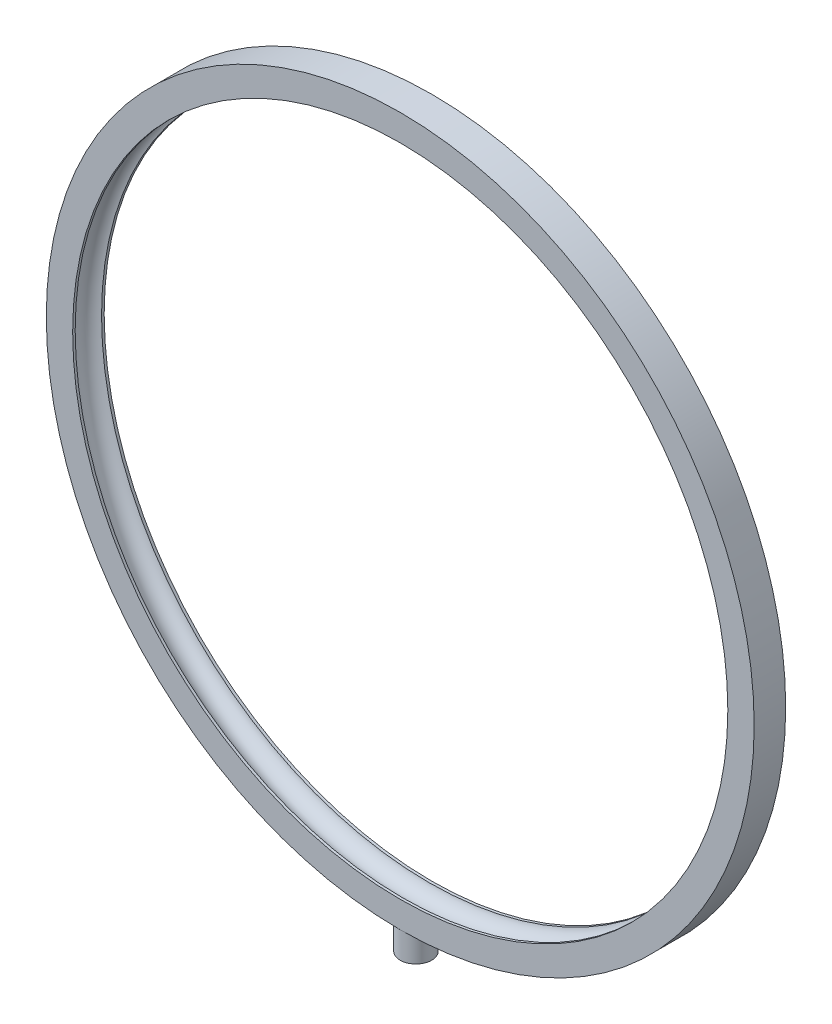
ISO-10303-21;
HEADER;
FILE_DESCRIPTION(('STEP AP214'),'2;1');
FILE_NAME('part.step','',(''),(''),'','','');
FILE_SCHEMA(('AUTOMOTIVE_DESIGN { 1 0 10303 214 1 1 1 1 }'));
ENDSEC;
DATA;
#1=APPLICATION_CONTEXT('core data for automotive mechanical design processes');
#2=APPLICATION_PROTOCOL_DEFINITION('international standard','automotive_design',2000,#1);
#3=PRODUCT_CONTEXT('',#1,'mechanical');
#4=PRODUCT('Part','Part','',(#3));
#5=PRODUCT_RELATED_PRODUCT_CATEGORY('part','',(#4));
#6=PRODUCT_DEFINITION_FORMATION('','',#4);
#7=PRODUCT_DEFINITION_CONTEXT('part definition',#1,'design');
#8=PRODUCT_DEFINITION('design','',#6,#7);
#9=PRODUCT_DEFINITION_SHAPE('','',#8);
#10=(LENGTH_UNIT() NAMED_UNIT(*) SI_UNIT(.MILLI.,.METRE.));
#11=(NAMED_UNIT(*) PLANE_ANGLE_UNIT() SI_UNIT($,.RADIAN.));
#12=(NAMED_UNIT(*) SI_UNIT($,.STERADIAN.) SOLID_ANGLE_UNIT());
#13=UNCERTAINTY_MEASURE_WITH_UNIT(LENGTH_MEASURE(1.E-05),#10,'distance_accuracy_value','');
#14=(GEOMETRIC_REPRESENTATION_CONTEXT(3) GLOBAL_UNCERTAINTY_ASSIGNED_CONTEXT((#13)) GLOBAL_UNIT_ASSIGNED_CONTEXT((#10,
#11,#12)) REPRESENTATION_CONTEXT('',''));
#15=CARTESIAN_POINT('',(0.,0.,0.));
#16=DIRECTION('',(0.,0.,1.));
#17=DIRECTION('',(1.,0.,0.));
#18=AXIS2_PLACEMENT_3D('',#15,#16,#17);
#19=CARTESIAN_POINT('',(0.,-144.24716621,0.));
#20=DIRECTION('',(0.,1.,0.));
#21=DIRECTION('',(0.,0.,1.));
#22=AXIS2_PLACEMENT_3D('',#19,#20,#21);
#23=CYLINDRICAL_SURFACE('',#22,5.975);
#24=CARTESIAN_POINT('',(0.,-144.24716621,0.));
#25=DIRECTION('',(0.,-1.,0.));
#26=DIRECTION('',(0.,0.,-1.));
#27=AXIS2_PLACEMENT_3D('',#24,#25,#26);
#28=CIRCLE('',#27,5.975);
#29=CARTESIAN_POINT('',(0.,-144.24716621,-5.975));
#30=VERTEX_POINT('',#29);
#31=EDGE_CURVE('E11',#30,#30,#28,.T.);
#32=ORIENTED_EDGE('',*,*,#31,.F.);
#33=EDGE_LOOP('',(#32));
#34=FACE_BOUND('',#33,.T.);
#35=CARTESIAN_POINT('',(0.,-134.24716621,0.));
#36=DIRECTION('',(0.,-1.,0.));
#37=DIRECTION('',(0.,0.,-1.));
#38=AXIS2_PLACEMENT_3D('',#35,#36,#37);
#39=CIRCLE('',#38,5.975);
#40=CARTESIAN_POINT('',(0.,-134.24716621,-5.975));
#41=VERTEX_POINT('',#40);
#42=EDGE_CURVE('E48',#41,#41,#39,.T.);
#43=ORIENTED_EDGE('',*,*,#42,.T.);
#44=EDGE_LOOP('',(#43));
#45=FACE_BOUND('',#44,.T.);
#46=ADVANCED_FACE('F45',(#34,#45),#23,.T.);
#47=CARTESIAN_POINT('',(0.,-144.24716621,0.));
#48=DIRECTION('',(0.,-1.,0.));
#49=DIRECTION('',(0.,0.,-1.));
#50=AXIS2_PLACEMENT_3D('',#47,#48,#49);
#51=PLANE('',#50);
#52=ORIENTED_EDGE('',*,*,#31,.T.);
#53=EDGE_LOOP('',(#52));
#54=FACE_BOUND('',#53,.T.);
#55=ADVANCED_FACE('F60',(#54),#51,.T.);
#56=CARTESIAN_POINT('',(0.,-134.24716621,0.));
#57=DIRECTION('',(0.,-1.,0.));
#58=DIRECTION('',(0.,0.,-1.));
#59=AXIS2_PLACEMENT_3D('',#56,#57,#58);
#60=PLANE('',#59);
#61=ORIENTED_EDGE('',*,*,#42,.F.);
#62=EDGE_LOOP('',(#61));
#63=FACE_BOUND('',#62,.T.);
#64=ADVANCED_FACE('F58',(#63),#60,.F.);
#65=CLOSED_SHELL('',(#46,#55,#64));
#66=MANIFOLD_SOLID_BREP('B2',#65);
#67=CARTESIAN_POINT('',(0.,0.,30.3023401497147));
#68=DIRECTION('',(0.,0.,1.));
#69=DIRECTION('',(1.,0.,0.));
#70=AXIS2_PLACEMENT_3D('',#67,#68,#69);
#71=CYLINDRICAL_SURFACE('',#70,124.24716621);
#72=CARTESIAN_POINT('',(0.,0.,-6.));
#73=DIRECTION('',(0.,0.,1.));
#74=DIRECTION('',(1.,0.,0.));
#75=AXIS2_PLACEMENT_3D('',#72,#73,#74);
#76=CIRCLE('',#75,124.24716621);
#77=CARTESIAN_POINT('',(124.24716621,0.,-6.));
#78=VERTEX_POINT('',#77);
#79=EDGE_CURVE('E44',#78,#78,#76,.T.);
#80=ORIENTED_EDGE('',*,*,#79,.F.);
#81=EDGE_LOOP('',(#80));
#82=FACE_BOUND('',#81,.T.);
#83=CARTESIAN_POINT('',(0.,0.,-5.));
#84=DIRECTION('',(0.,0.,1.));
#85=DIRECTION('',(1.,0.,0.));
#86=AXIS2_PLACEMENT_3D('',#83,#84,#85);
#87=CIRCLE('',#86,124.24716621);
#88=CARTESIAN_POINT('',(124.24716621,0.,-5.));
#89=VERTEX_POINT('',#88);
#90=EDGE_CURVE('E113',#89,#89,#87,.T.);
#91=ORIENTED_EDGE('',*,*,#90,.T.);
#92=EDGE_LOOP('',(#91));
#93=FACE_BOUND('',#92,.T.);
#94=ADVANCED_FACE('F86',(#82,#93),#71,.F.);
#95=CARTESIAN_POINT('',(0.,134.24716621,-6.));
#96=DIRECTION('',(0.,0.,1.));
#97=DIRECTION('',(1.,0.,0.));
#98=AXIS2_PLACEMENT_3D('',#95,#96,#97);
#99=PLANE('',#98);
#100=CARTESIAN_POINT('',(0.,0.,-6.));
#101=DIRECTION('',(0.,0.,1.));
#102=DIRECTION('',(1.,0.,0.));
#103=AXIS2_PLACEMENT_3D('',#100,#101,#102);
#104=CIRCLE('',#103,134.24716621);
#105=CARTESIAN_POINT('',(134.24716621,0.,-6.));
#106=VERTEX_POINT('',#105);
#107=EDGE_CURVE('E93',#106,#106,#104,.T.);
#108=ORIENTED_EDGE('',*,*,#107,.F.);
#109=EDGE_LOOP('',(#108));
#110=FACE_BOUND('',#109,.T.);
#111=ORIENTED_EDGE('',*,*,#79,.T.);
#112=EDGE_LOOP('',(#111));
#113=FACE_BOUND('',#112,.T.);
#114=ADVANCED_FACE('F139',(#110,#113),#99,.F.);
#115=CARTESIAN_POINT('',(0.,0.,30.3023401497147));
#116=DIRECTION('',(0.,0.,1.));
#117=DIRECTION('',(1.,0.,0.));
#118=AXIS2_PLACEMENT_3D('',#115,#116,#117);
#119=CYLINDRICAL_SURFACE('',#118,134.24716621);
#120=CARTESIAN_POINT('',(0.,0.,5.95439975274856));
#121=DIRECTION('',(0.,0.,1.));
#122=DIRECTION('',(1.,0.,0.));
#123=AXIS2_PLACEMENT_3D('',#120,#121,#122);
#124=CIRCLE('',#123,134.24716621);
#125=CARTESIAN_POINT('',(134.24716621,0.,5.95439975274856));
#126=VERTEX_POINT('',#125);
#127=EDGE_CURVE('E98',#126,#126,#124,.T.);
#128=ORIENTED_EDGE('',*,*,#127,.F.);
#129=EDGE_LOOP('',(#128));
#130=FACE_BOUND('',#129,.T.);
#131=ORIENTED_EDGE('',*,*,#107,.T.);
#132=EDGE_LOOP('',(#131));
#133=FACE_BOUND('',#132,.T.);
#134=ADVANCED_FACE('F134',(#130,#133),#119,.T.);
#135=CARTESIAN_POINT('',(0.,124.24716621,5.95439975274856));
#136=DIRECTION('',(0.,0.,-1.));
#137=DIRECTION('',(-1.,0.,0.));
#138=AXIS2_PLACEMENT_3D('',#135,#136,#137);
#139=PLANE('',#138);
#140=CARTESIAN_POINT('',(0.,0.,5.95439975274856));
#141=DIRECTION('',(0.,0.,1.));
#142=DIRECTION('',(1.,0.,0.));
#143=AXIS2_PLACEMENT_3D('',#140,#141,#142);
#144=CIRCLE('',#143,124.24716621);
#145=CARTESIAN_POINT('',(124.24716621,0.,5.95439975274856));
#146=VERTEX_POINT('',#145);
#147=EDGE_CURVE('E103',#146,#146,#144,.T.);
#148=ORIENTED_EDGE('',*,*,#147,.F.);
#149=EDGE_LOOP('',(#148));
#150=FACE_BOUND('',#149,.T.);
#151=ORIENTED_EDGE('',*,*,#127,.T.);
#152=EDGE_LOOP('',(#151));
#153=FACE_BOUND('',#152,.T.);
#154=ADVANCED_FACE('F128',(#150,#153),#139,.F.);
#155=CARTESIAN_POINT('',(0.,0.,30.3023401497147));
#156=DIRECTION('',(0.,0.,1.));
#157=DIRECTION('',(1.,0.,0.));
#158=AXIS2_PLACEMENT_3D('',#155,#156,#157);
#159=CYLINDRICAL_SURFACE('',#158,124.24716621);
#160=CARTESIAN_POINT('',(0.,0.,5.));
#161=DIRECTION('',(0.,0.,1.));
#162=DIRECTION('',(1.,0.,0.));
#163=AXIS2_PLACEMENT_3D('',#160,#161,#162);
#164=CIRCLE('',#163,124.24716621);
#165=CARTESIAN_POINT('',(124.24716621,0.,5.));
#166=VERTEX_POINT('',#165);
#167=EDGE_CURVE('E109',#166,#166,#164,.T.);
#168=ORIENTED_EDGE('',*,*,#167,.F.);
#169=EDGE_LOOP('',(#168));
#170=FACE_BOUND('',#169,.T.);
#171=ORIENTED_EDGE('',*,*,#147,.T.);
#172=EDGE_LOOP('',(#171));
#173=FACE_BOUND('',#172,.T.);
#174=ADVANCED_FACE('F122',(#170,#173),#159,.F.);
#175=CARTESIAN_POINT('',(0.,0.,0.));
#176=DIRECTION('',(0.,0.,1.));
#177=DIRECTION('',(1.,0.,0.));
#178=AXIS2_PLACEMENT_3D('',#175,#176,#177);
#179=TOROIDAL_SURFACE('',#178,123.12216621,5.125);
#180=ORIENTED_EDGE('',*,*,#90,.F.);
#181=EDGE_LOOP('',(#180));
#182=FACE_BOUND('',#181,.T.);
#183=ORIENTED_EDGE('',*,*,#167,.T.);
#184=EDGE_LOOP('',(#183));
#185=FACE_BOUND('',#184,.T.);
#186=ADVANCED_FACE('F119',(#182,#185),#179,.F.);
#187=CLOSED_SHELL('',(#94,#114,#134,#154,#174,#186));
#188=MANIFOLD_SOLID_BREP('B6',#187);
#189=ADVANCED_BREP_SHAPE_REPRESENTATION('',(#18,#66,#188),#14);
#190=SHAPE_DEFINITION_REPRESENTATION(#9,#189);
ENDSEC;
END-ISO-10303-21;
